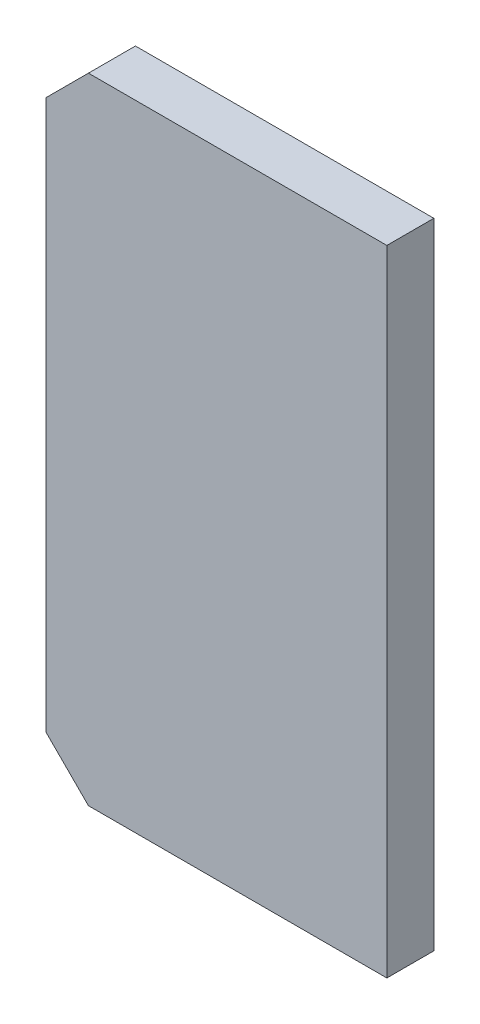
ISO-10303-21;
HEADER;
FILE_DESCRIPTION(('STEP AP214'),'2;1');
FILE_NAME('part.step','',(''),(''),'','','');
FILE_SCHEMA(('AUTOMOTIVE_DESIGN { 1 0 10303 214 1 1 1 1 }'));
ENDSEC;
DATA;
#1=APPLICATION_CONTEXT('core data for automotive mechanical design processes');
#2=APPLICATION_PROTOCOL_DEFINITION('international standard','automotive_design',2000,#1);
#3=PRODUCT_CONTEXT('',#1,'mechanical');
#4=PRODUCT('Part','Part','',(#3));
#5=PRODUCT_RELATED_PRODUCT_CATEGORY('part','',(#4));
#6=PRODUCT_DEFINITION_FORMATION('','',#4);
#7=PRODUCT_DEFINITION_CONTEXT('part definition',#1,'design');
#8=PRODUCT_DEFINITION('design','',#6,#7);
#9=PRODUCT_DEFINITION_SHAPE('','',#8);
#10=(LENGTH_UNIT() NAMED_UNIT(*) SI_UNIT(.MILLI.,.METRE.));
#11=(NAMED_UNIT(*) PLANE_ANGLE_UNIT() SI_UNIT($,.RADIAN.));
#12=(NAMED_UNIT(*) SI_UNIT($,.STERADIAN.) SOLID_ANGLE_UNIT());
#13=UNCERTAINTY_MEASURE_WITH_UNIT(LENGTH_MEASURE(1.E-05),#10,'distance_accuracy_value','');
#14=(GEOMETRIC_REPRESENTATION_CONTEXT(3) GLOBAL_UNCERTAINTY_ASSIGNED_CONTEXT((#13)) GLOBAL_UNIT_ASSIGNED_CONTEXT((#10,
#11,#12)) REPRESENTATION_CONTEXT('',''));
#15=CARTESIAN_POINT('',(0.,0.,0.));
#16=DIRECTION('',(0.,0.,1.));
#17=DIRECTION('',(1.,0.,0.));
#18=AXIS2_PLACEMENT_3D('',#15,#16,#17);
#19=CARTESIAN_POINT('',(0.,-135.,20.));
#20=DIRECTION('',(-1.,0.,0.));
#21=DIRECTION('',(0.,0.,1.));
#22=AXIS2_PLACEMENT_3D('',#19,#20,#21);
#23=PLANE('',#22);
#24=DIRECTION('',(0.,1.,0.));
#25=VECTOR('',#24,1.);
#26=CARTESIAN_POINT('',(0.,-135.,0.));
#27=LINE('',#26,#25);
#28=CARTESIAN_POINT('',(0.,-135.,0.));
#29=VERTEX_POINT('',#28);
#30=CARTESIAN_POINT('',(0.,135.,0.));
#31=VERTEX_POINT('',#30);
#32=EDGE_CURVE('E119',#29,#31,#27,.T.);
#33=ORIENTED_EDGE('',*,*,#32,.T.);
#34=DIRECTION('',(0.,0.,-1.));
#35=VECTOR('',#34,1.);
#36=CARTESIAN_POINT('',(0.,135.,20.));
#37=LINE('',#36,#35);
#38=CARTESIAN_POINT('',(0.,135.,20.));
#39=VERTEX_POINT('',#38);
#40=EDGE_CURVE('E11',#39,#31,#37,.T.);
#41=ORIENTED_EDGE('',*,*,#40,.F.);
#42=DIRECTION('',(0.,1.,0.));
#43=VECTOR('',#42,1.);
#44=CARTESIAN_POINT('',(0.,-135.,20.));
#45=LINE('',#44,#43);
#46=CARTESIAN_POINT('',(0.,-135.,20.));
#47=VERTEX_POINT('',#46);
#48=EDGE_CURVE('E129',#47,#39,#45,.T.);
#49=ORIENTED_EDGE('',*,*,#48,.F.);
#50=DIRECTION('',(0.,0.,-1.));
#51=VECTOR('',#50,1.);
#52=CARTESIAN_POINT('',(0.,-135.,20.));
#53=LINE('',#52,#51);
#54=EDGE_CURVE('E115',#47,#29,#53,.T.);
#55=ORIENTED_EDGE('',*,*,#54,.T.);
#56=EDGE_LOOP('',(#33,#41,#49,#55));
#57=FACE_BOUND('',#56,.T.);
#58=ADVANCED_FACE('F35',(#57),#23,.F.);
#59=CARTESIAN_POINT('',(0.,135.,20.));
#60=DIRECTION('',(0.,-1.,0.));
#61=DIRECTION('',(0.,0.,-1.));
#62=AXIS2_PLACEMENT_3D('',#59,#60,#61);
#63=PLANE('',#62);
#64=DIRECTION('',(-1.,0.,0.));
#65=VECTOR('',#64,1.);
#66=CARTESIAN_POINT('',(0.,135.,0.));
#67=LINE('',#66,#65);
#68=CARTESIAN_POINT('',(-127.,135.,0.));
#69=VERTEX_POINT('',#68);
#70=EDGE_CURVE('E122',#31,#69,#67,.T.);
#71=ORIENTED_EDGE('',*,*,#70,.T.);
#72=DIRECTION('',(0.,0.,-1.));
#73=VECTOR('',#72,1.);
#74=CARTESIAN_POINT('',(-127.,135.,20.));
#75=LINE('',#74,#73);
#76=CARTESIAN_POINT('',(-127.,135.,20.));
#77=VERTEX_POINT('',#76);
#78=EDGE_CURVE('E43',#77,#69,#75,.T.);
#79=ORIENTED_EDGE('',*,*,#78,.F.);
#80=DIRECTION('',(-1.,0.,0.));
#81=VECTOR('',#80,1.);
#82=CARTESIAN_POINT('',(0.,135.,20.));
#83=LINE('',#82,#81);
#84=EDGE_CURVE('E88',#39,#77,#83,.T.);
#85=ORIENTED_EDGE('',*,*,#84,.F.);
#86=ORIENTED_EDGE('',*,*,#40,.T.);
#87=EDGE_LOOP('',(#71,#79,#85,#86));
#88=FACE_BOUND('',#87,.T.);
#89=ADVANCED_FACE('F153',(#88),#63,.F.);
#90=CARTESIAN_POINT('',(-127.,135.,20.));
#91=DIRECTION('',(0.707106781186548,-0.707106781186547,0.));
#92=DIRECTION('',(0.707106781186547,0.707106781186548,0.));
#93=AXIS2_PLACEMENT_3D('',#90,#91,#92);
#94=PLANE('',#93);
#95=DIRECTION('',(-0.707106781186547,-0.707106781186548,0.));
#96=VECTOR('',#95,1.);
#97=CARTESIAN_POINT('',(-127.,135.,0.));
#98=LINE('',#97,#96);
#99=CARTESIAN_POINT('',(-145.,117.,0.));
#100=VERTEX_POINT('',#99);
#101=EDGE_CURVE('E124',#69,#100,#98,.T.);
#102=ORIENTED_EDGE('',*,*,#101,.T.);
#103=DIRECTION('',(0.,0.,-1.));
#104=VECTOR('',#103,1.);
#105=CARTESIAN_POINT('',(-145.,117.,20.));
#106=LINE('',#105,#104);
#107=CARTESIAN_POINT('',(-145.,117.,20.));
#108=VERTEX_POINT('',#107);
#109=EDGE_CURVE('E110',#108,#100,#106,.T.);
#110=ORIENTED_EDGE('',*,*,#109,.F.);
#111=DIRECTION('',(-0.707106781186547,-0.707106781186548,0.));
#112=VECTOR('',#111,1.);
#113=CARTESIAN_POINT('',(-127.,135.,20.));
#114=LINE('',#113,#112);
#115=EDGE_CURVE('E101',#77,#108,#114,.T.);
#116=ORIENTED_EDGE('',*,*,#115,.F.);
#117=ORIENTED_EDGE('',*,*,#78,.T.);
#118=EDGE_LOOP('',(#102,#110,#116,#117));
#119=FACE_BOUND('',#118,.T.);
#120=ADVANCED_FACE('F135',(#119),#94,.F.);
#121=CARTESIAN_POINT('',(-145.,117.,20.));
#122=DIRECTION('',(1.,0.,0.));
#123=DIRECTION('',(0.,0.,-1.));
#124=AXIS2_PLACEMENT_3D('',#121,#122,#123);
#125=PLANE('',#124);
#126=DIRECTION('',(0.,-1.,0.));
#127=VECTOR('',#126,1.);
#128=CARTESIAN_POINT('',(-145.,117.,0.));
#129=LINE('',#128,#127);
#130=CARTESIAN_POINT('',(-145.,-117.,0.));
#131=VERTEX_POINT('',#130);
#132=EDGE_CURVE('E109',#100,#131,#129,.T.);
#133=ORIENTED_EDGE('',*,*,#132,.T.);
#134=DIRECTION('',(0.,0.,-1.));
#135=VECTOR('',#134,1.);
#136=CARTESIAN_POINT('',(-145.,-117.,20.));
#137=LINE('',#136,#135);
#138=CARTESIAN_POINT('',(-145.,-117.,20.));
#139=VERTEX_POINT('',#138);
#140=EDGE_CURVE('E106',#139,#131,#137,.T.);
#141=ORIENTED_EDGE('',*,*,#140,.F.);
#142=DIRECTION('',(0.,-1.,0.));
#143=VECTOR('',#142,1.);
#144=CARTESIAN_POINT('',(-145.,117.,20.));
#145=LINE('',#144,#143);
#146=EDGE_CURVE('E95',#108,#139,#145,.T.);
#147=ORIENTED_EDGE('',*,*,#146,.F.);
#148=ORIENTED_EDGE('',*,*,#109,.T.);
#149=EDGE_LOOP('',(#133,#141,#147,#148));
#150=FACE_BOUND('',#149,.T.);
#151=ADVANCED_FACE('F107',(#150),#125,.F.);
#152=CARTESIAN_POINT('',(-127.,-135.,20.));
#153=DIRECTION('',(0.707106781186548,0.707106781186548,0.));
#154=DIRECTION('',(-0.707106781186548,0.707106781186548,0.));
#155=AXIS2_PLACEMENT_3D('',#152,#153,#154);
#156=PLANE('',#155);
#157=DIRECTION('',(0.707106781186548,-0.707106781186548,0.));
#158=VECTOR('',#157,1.);
#159=CARTESIAN_POINT('',(-127.,-135.,0.));
#160=LINE('',#159,#158);
#161=CARTESIAN_POINT('',(-127.,-135.,0.));
#162=VERTEX_POINT('',#161);
#163=EDGE_CURVE('E74',#131,#162,#160,.T.);
#164=ORIENTED_EDGE('',*,*,#163,.T.);
#165=DIRECTION('',(0.,0.,-1.));
#166=VECTOR('',#165,1.);
#167=CARTESIAN_POINT('',(-127.,-135.,20.));
#168=LINE('',#167,#166);
#169=CARTESIAN_POINT('',(-127.,-135.,20.));
#170=VERTEX_POINT('',#169);
#171=EDGE_CURVE('E111',#170,#162,#168,.T.);
#172=ORIENTED_EDGE('',*,*,#171,.F.);
#173=DIRECTION('',(0.707106781186548,-0.707106781186548,0.));
#174=VECTOR('',#173,1.);
#175=CARTESIAN_POINT('',(-127.,-135.,20.));
#176=LINE('',#175,#174);
#177=EDGE_CURVE('E99',#139,#170,#176,.T.);
#178=ORIENTED_EDGE('',*,*,#177,.F.);
#179=ORIENTED_EDGE('',*,*,#140,.T.);
#180=EDGE_LOOP('',(#164,#172,#178,#179));
#181=FACE_BOUND('',#180,.T.);
#182=ADVANCED_FACE('F113',(#181),#156,.F.);
#183=CARTESIAN_POINT('',(-127.,-135.,20.));
#184=DIRECTION('',(0.,1.,0.));
#185=DIRECTION('',(0.,0.,1.));
#186=AXIS2_PLACEMENT_3D('',#183,#184,#185);
#187=PLANE('',#186);
#188=DIRECTION('',(1.,0.,0.));
#189=VECTOR('',#188,1.);
#190=CARTESIAN_POINT('',(-127.,-135.,0.));
#191=LINE('',#190,#189);
#192=EDGE_CURVE('E80',#162,#29,#191,.T.);
#193=ORIENTED_EDGE('',*,*,#192,.T.);
#194=ORIENTED_EDGE('',*,*,#54,.F.);
#195=DIRECTION('',(1.,0.,0.));
#196=VECTOR('',#195,1.);
#197=CARTESIAN_POINT('',(-127.,-135.,20.));
#198=LINE('',#197,#196);
#199=EDGE_CURVE('E51',#170,#47,#198,.T.);
#200=ORIENTED_EDGE('',*,*,#199,.F.);
#201=ORIENTED_EDGE('',*,*,#171,.T.);
#202=EDGE_LOOP('',(#193,#194,#200,#201));
#203=FACE_BOUND('',#202,.T.);
#204=ADVANCED_FACE('F142',(#203),#187,.F.);
#205=CARTESIAN_POINT('',(0.,0.,20.));
#206=DIRECTION('',(0.,0.,1.));
#207=DIRECTION('',(1.,0.,0.));
#208=AXIS2_PLACEMENT_3D('',#205,#206,#207);
#209=PLANE('',#208);
#210=ORIENTED_EDGE('',*,*,#48,.T.);
#211=ORIENTED_EDGE('',*,*,#84,.T.);
#212=ORIENTED_EDGE('',*,*,#115,.T.);
#213=ORIENTED_EDGE('',*,*,#146,.T.);
#214=ORIENTED_EDGE('',*,*,#177,.T.);
#215=ORIENTED_EDGE('',*,*,#199,.T.);
#216=EDGE_LOOP('',(#210,#211,#212,#213,#214,#215));
#217=FACE_BOUND('',#216,.T.);
#218=ADVANCED_FACE('F97',(#217),#209,.T.);
#219=CARTESIAN_POINT('',(0.,0.,0.));
#220=DIRECTION('',(0.,0.,1.));
#221=DIRECTION('',(1.,0.,0.));
#222=AXIS2_PLACEMENT_3D('',#219,#220,#221);
#223=PLANE('',#222);
#224=ORIENTED_EDGE('',*,*,#32,.F.);
#225=ORIENTED_EDGE('',*,*,#192,.F.);
#226=ORIENTED_EDGE('',*,*,#163,.F.);
#227=ORIENTED_EDGE('',*,*,#132,.F.);
#228=ORIENTED_EDGE('',*,*,#101,.F.);
#229=ORIENTED_EDGE('',*,*,#70,.F.);
#230=EDGE_LOOP('',(#224,#225,#226,#227,#228,#229));
#231=FACE_BOUND('',#230,.T.);
#232=ADVANCED_FACE('F138',(#231),#223,.F.);
#233=CLOSED_SHELL('',(#58,#89,#120,#151,#182,#204,#218,#232));
#234=MANIFOLD_SOLID_BREP('B2',#233);
#235=ADVANCED_BREP_SHAPE_REPRESENTATION('',(#18,#234),#14);
#236=SHAPE_DEFINITION_REPRESENTATION(#9,#235);
ENDSEC;
END-ISO-10303-21;
